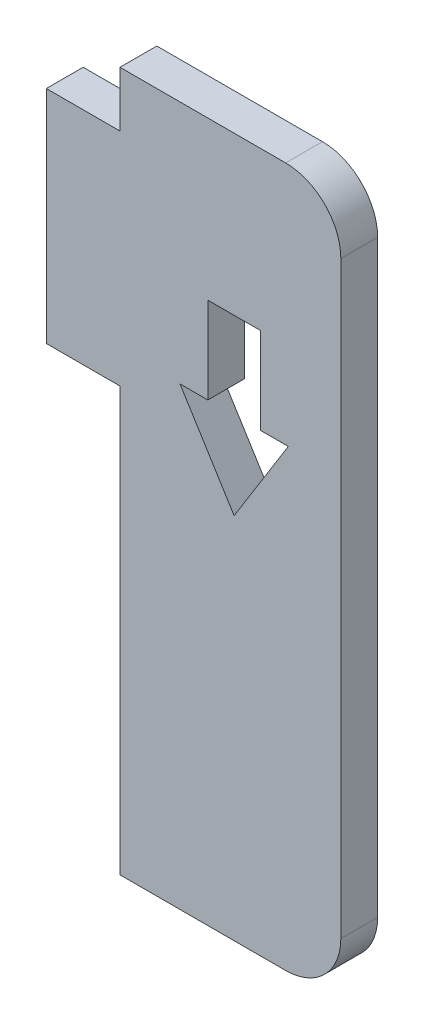
ISO-10303-21;
HEADER;
FILE_DESCRIPTION(('STEP AP214'),'2;1');
FILE_NAME('part.step','',(''),(''),'','','');
FILE_SCHEMA(('AUTOMOTIVE_DESIGN { 1 0 10303 214 1 1 1 1 }'));
ENDSEC;
DATA;
#1=APPLICATION_CONTEXT('core data for automotive mechanical design processes');
#2=APPLICATION_PROTOCOL_DEFINITION('international standard','automotive_design',2000,#1);
#3=PRODUCT_CONTEXT('',#1,'mechanical');
#4=PRODUCT('Part','Part','',(#3));
#5=PRODUCT_RELATED_PRODUCT_CATEGORY('part','',(#4));
#6=PRODUCT_DEFINITION_FORMATION('','',#4);
#7=PRODUCT_DEFINITION_CONTEXT('part definition',#1,'design');
#8=PRODUCT_DEFINITION('design','',#6,#7);
#9=PRODUCT_DEFINITION_SHAPE('','',#8);
#10=(LENGTH_UNIT() NAMED_UNIT(*) SI_UNIT(.MILLI.,.METRE.));
#11=(NAMED_UNIT(*) PLANE_ANGLE_UNIT() SI_UNIT($,.RADIAN.));
#12=(NAMED_UNIT(*) SI_UNIT($,.STERADIAN.) SOLID_ANGLE_UNIT());
#13=UNCERTAINTY_MEASURE_WITH_UNIT(LENGTH_MEASURE(1.E-05),#10,'distance_accuracy_value','');
#14=(GEOMETRIC_REPRESENTATION_CONTEXT(3) GLOBAL_UNCERTAINTY_ASSIGNED_CONTEXT((#13)) GLOBAL_UNIT_ASSIGNED_CONTEXT((#10,
#11,#12)) REPRESENTATION_CONTEXT('',''));
#15=CARTESIAN_POINT('',(0.,0.,0.));
#16=DIRECTION('',(0.,0.,1.));
#17=DIRECTION('',(1.,0.,0.));
#18=AXIS2_PLACEMENT_3D('',#15,#16,#17);
#19=CARTESIAN_POINT('',(4.,0.,2.));
#20=DIRECTION('',(1.,0.,0.));
#21=DIRECTION('',(0.,1.,0.));
#22=AXIS2_PLACEMENT_3D('',#19,#20,#21);
#23=PLANE('',#22);
#24=DIRECTION('',(0.,-1.,0.));
#25=VECTOR('',#24,1.);
#26=CARTESIAN_POINT('',(4.,0.,0.));
#27=LINE('',#26,#25);
#28=CARTESIAN_POINT('',(4.,-12.,0.));
#29=VERTEX_POINT('',#28);
#30=CARTESIAN_POINT('',(4.,-35.,0.));
#31=VERTEX_POINT('',#30);
#32=EDGE_CURVE('E234',#29,#31,#27,.T.);
#33=ORIENTED_EDGE('',*,*,#32,.T.);
#34=DIRECTION('',(0.,0.,-1.));
#35=VECTOR('',#34,1.);
#36=CARTESIAN_POINT('',(4.,-35.,2.));
#37=LINE('',#36,#35);
#38=CARTESIAN_POINT('',(4.,-35.,2.));
#39=VERTEX_POINT('',#38);
#40=EDGE_CURVE('E319',#39,#31,#37,.T.);
#41=ORIENTED_EDGE('',*,*,#40,.F.);
#42=DIRECTION('',(0.,-1.,0.));
#43=VECTOR('',#42,1.);
#44=CARTESIAN_POINT('',(4.,0.,2.));
#45=LINE('',#44,#43);
#46=CARTESIAN_POINT('',(4.,-12.,2.));
#47=VERTEX_POINT('',#46);
#48=EDGE_CURVE('E249',#47,#39,#45,.T.);
#49=ORIENTED_EDGE('',*,*,#48,.F.);
#50=DIRECTION('',(0.,0.,-1.));
#51=VECTOR('',#50,1.);
#52=CARTESIAN_POINT('',(4.,-12.,2.));
#53=LINE('',#52,#51);
#54=EDGE_CURVE('E275',#47,#29,#53,.T.);
#55=ORIENTED_EDGE('',*,*,#54,.T.);
#56=EDGE_LOOP('',(#33,#41,#49,#55));
#57=FACE_BOUND('',#56,.T.);
#58=ADVANCED_FACE('F38',(#57),#23,.F.);
#59=CARTESIAN_POINT('',(0.,-35.,2.));
#60=DIRECTION('',(0.,1.,0.));
#61=DIRECTION('',(0.,0.,1.));
#62=AXIS2_PLACEMENT_3D('',#59,#60,#61);
#63=PLANE('',#62);
#64=DIRECTION('',(1.,0.,0.));
#65=VECTOR('',#64,1.);
#66=CARTESIAN_POINT('',(0.,-35.,0.));
#67=LINE('',#66,#65);
#68=CARTESIAN_POINT('',(13.,-35.,0.));
#69=VERTEX_POINT('',#68);
#70=EDGE_CURVE('E279',#31,#69,#67,.T.);
#71=ORIENTED_EDGE('',*,*,#70,.T.);
#72=DIRECTION('',(0.,0.,-1.));
#73=VECTOR('',#72,1.);
#74=CARTESIAN_POINT('',(13.,-35.,2.));
#75=LINE('',#74,#73);
#76=CARTESIAN_POINT('',(13.,-35.,2.));
#77=VERTEX_POINT('',#76);
#78=EDGE_CURVE('E62',#69,#77,#75,.F.);
#79=ORIENTED_EDGE('',*,*,#78,.T.);
#80=DIRECTION('',(1.,0.,0.));
#81=VECTOR('',#80,1.);
#82=CARTESIAN_POINT('',(0.,-35.,2.));
#83=LINE('',#82,#81);
#84=EDGE_CURVE('E253',#39,#77,#83,.T.);
#85=ORIENTED_EDGE('',*,*,#84,.F.);
#86=ORIENTED_EDGE('',*,*,#40,.T.);
#87=EDGE_LOOP('',(#71,#79,#85,#86));
#88=FACE_BOUND('',#87,.T.);
#89=ADVANCED_FACE('F351',(#88),#63,.F.);
#90=CARTESIAN_POINT('',(16.,0.,2.));
#91=DIRECTION('',(-1.,0.,0.));
#92=DIRECTION('',(0.,0.,1.));
#93=AXIS2_PLACEMENT_3D('',#90,#91,#92);
#94=PLANE('',#93);
#95=DIRECTION('',(0.,1.,0.));
#96=VECTOR('',#95,1.);
#97=CARTESIAN_POINT('',(16.,0.,2.));
#98=LINE('',#97,#96);
#99=CARTESIAN_POINT('',(16.,-32.,2.));
#100=VERTEX_POINT('',#99);
#101=CARTESIAN_POINT('',(16.,0.,2.));
#102=VERTEX_POINT('',#101);
#103=EDGE_CURVE('E257',#100,#102,#98,.T.);
#104=ORIENTED_EDGE('',*,*,#103,.F.);
#105=DIRECTION('',(0.,0.,-1.));
#106=VECTOR('',#105,1.);
#107=CARTESIAN_POINT('',(16.,-32.,2.));
#108=LINE('',#107,#106);
#109=CARTESIAN_POINT('',(16.,-32.,0.));
#110=VERTEX_POINT('',#109);
#111=EDGE_CURVE('E326',#100,#110,#108,.T.);
#112=ORIENTED_EDGE('',*,*,#111,.T.);
#113=DIRECTION('',(0.,1.,0.));
#114=VECTOR('',#113,1.);
#115=CARTESIAN_POINT('',(16.,0.,0.));
#116=LINE('',#115,#114);
#117=CARTESIAN_POINT('',(16.,0.,0.));
#118=VERTEX_POINT('',#117);
#119=EDGE_CURVE('E282',#110,#118,#116,.T.);
#120=ORIENTED_EDGE('',*,*,#119,.T.);
#121=DIRECTION('',(0.,0.,-1.));
#122=VECTOR('',#121,1.);
#123=CARTESIAN_POINT('',(16.,0.,2.));
#124=LINE('',#123,#122);
#125=EDGE_CURVE('E323',#118,#102,#124,.F.);
#126=ORIENTED_EDGE('',*,*,#125,.T.);
#127=EDGE_LOOP('',(#104,#112,#120,#126));
#128=FACE_BOUND('',#127,.T.);
#129=ADVANCED_FACE('F346',(#128),#94,.F.);
#130=CARTESIAN_POINT('',(0.,3.,2.));
#131=DIRECTION('',(0.,-1.,0.));
#132=DIRECTION('',(1.,0.,0.));
#133=AXIS2_PLACEMENT_3D('',#130,#131,#132);
#134=PLANE('',#133);
#135=DIRECTION('',(-1.,0.,0.));
#136=VECTOR('',#135,1.);
#137=CARTESIAN_POINT('',(0.,3.,2.));
#138=LINE('',#137,#136);
#139=CARTESIAN_POINT('',(13.,3.,2.));
#140=VERTEX_POINT('',#139);
#141=CARTESIAN_POINT('',(4.,3.,2.));
#142=VERTEX_POINT('',#141);
#143=EDGE_CURVE('E260',#140,#142,#138,.T.);
#144=ORIENTED_EDGE('',*,*,#143,.F.);
#145=DIRECTION('',(0.,0.,-1.));
#146=VECTOR('',#145,1.);
#147=CARTESIAN_POINT('',(13.,3.,2.));
#148=LINE('',#147,#146);
#149=CARTESIAN_POINT('',(13.,3.,0.));
#150=VERTEX_POINT('',#149);
#151=EDGE_CURVE('E11',#140,#150,#148,.T.);
#152=ORIENTED_EDGE('',*,*,#151,.T.);
#153=DIRECTION('',(-1.,0.,0.));
#154=VECTOR('',#153,1.);
#155=CARTESIAN_POINT('',(0.,3.,0.));
#156=LINE('',#155,#154);
#157=CARTESIAN_POINT('',(4.,3.,0.));
#158=VERTEX_POINT('',#157);
#159=EDGE_CURVE('E286',#150,#158,#156,.T.);
#160=ORIENTED_EDGE('',*,*,#159,.T.);
#161=DIRECTION('',(0.,0.,-1.));
#162=VECTOR('',#161,1.);
#163=CARTESIAN_POINT('',(4.,3.,2.));
#164=LINE('',#163,#162);
#165=EDGE_CURVE('E315',#142,#158,#164,.T.);
#166=ORIENTED_EDGE('',*,*,#165,.F.);
#167=EDGE_LOOP('',(#144,#152,#160,#166));
#168=FACE_BOUND('',#167,.T.);
#169=ADVANCED_FACE('F378',(#168),#134,.F.);
#170=CARTESIAN_POINT('',(4.,0.,2.));
#171=DIRECTION('',(1.,0.,0.));
#172=DIRECTION('',(0.,0.,-1.));
#173=AXIS2_PLACEMENT_3D('',#170,#171,#172);
#174=PLANE('',#173);
#175=DIRECTION('',(0.,-1.,0.));
#176=VECTOR('',#175,1.);
#177=CARTESIAN_POINT('',(4.,0.,0.));
#178=LINE('',#177,#176);
#179=CARTESIAN_POINT('',(4.,0.,0.));
#180=VERTEX_POINT('',#179);
#181=EDGE_CURVE('E289',#158,#180,#178,.T.);
#182=ORIENTED_EDGE('',*,*,#181,.T.);
#183=DIRECTION('',(0.,0.,-1.));
#184=VECTOR('',#183,1.);
#185=CARTESIAN_POINT('',(4.,0.,2.));
#186=LINE('',#185,#184);
#187=CARTESIAN_POINT('',(4.,0.,2.));
#188=VERTEX_POINT('',#187);
#189=EDGE_CURVE('E311',#188,#180,#186,.T.);
#190=ORIENTED_EDGE('',*,*,#189,.F.);
#191=DIRECTION('',(0.,-1.,0.));
#192=VECTOR('',#191,1.);
#193=CARTESIAN_POINT('',(4.,0.,2.));
#194=LINE('',#193,#192);
#195=EDGE_CURVE('E263',#142,#188,#194,.T.);
#196=ORIENTED_EDGE('',*,*,#195,.F.);
#197=ORIENTED_EDGE('',*,*,#165,.T.);
#198=EDGE_LOOP('',(#182,#190,#196,#197));
#199=FACE_BOUND('',#198,.T.);
#200=ADVANCED_FACE('F374',(#199),#174,.F.);
#201=CARTESIAN_POINT('',(0.,0.,2.));
#202=DIRECTION('',(0.,-1.,0.));
#203=DIRECTION('',(1.,0.,0.));
#204=AXIS2_PLACEMENT_3D('',#201,#202,#203);
#205=PLANE('',#204);
#206=DIRECTION('',(-1.,0.,0.));
#207=VECTOR('',#206,1.);
#208=CARTESIAN_POINT('',(0.,0.,0.));
#209=LINE('',#208,#207);
#210=CARTESIAN_POINT('',(0.,0.,0.));
#211=VERTEX_POINT('',#210);
#212=EDGE_CURVE('E292',#180,#211,#209,.T.);
#213=ORIENTED_EDGE('',*,*,#212,.T.);
#214=DIRECTION('',(0.,0.,-1.));
#215=VECTOR('',#214,1.);
#216=CARTESIAN_POINT('',(0.,0.,2.));
#217=LINE('',#216,#215);
#218=CARTESIAN_POINT('',(0.,0.,2.));
#219=VERTEX_POINT('',#218);
#220=EDGE_CURVE('E307',#219,#211,#217,.T.);
#221=ORIENTED_EDGE('',*,*,#220,.F.);
#222=DIRECTION('',(-1.,0.,0.));
#223=VECTOR('',#222,1.);
#224=CARTESIAN_POINT('',(0.,0.,2.));
#225=LINE('',#224,#223);
#226=EDGE_CURVE('E266',#188,#219,#225,.T.);
#227=ORIENTED_EDGE('',*,*,#226,.F.);
#228=ORIENTED_EDGE('',*,*,#189,.T.);
#229=EDGE_LOOP('',(#213,#221,#227,#228));
#230=FACE_BOUND('',#229,.T.);
#231=ADVANCED_FACE('F369',(#230),#205,.F.);
#232=CARTESIAN_POINT('',(0.,0.,2.));
#233=DIRECTION('',(1.,0.,0.));
#234=DIRECTION('',(0.,0.,-1.));
#235=AXIS2_PLACEMENT_3D('',#232,#233,#234);
#236=PLANE('',#235);
#237=DIRECTION('',(0.,-1.,0.));
#238=VECTOR('',#237,1.);
#239=CARTESIAN_POINT('',(0.,0.,0.));
#240=LINE('',#239,#238);
#241=CARTESIAN_POINT('',(0.,-12.,0.));
#242=VERTEX_POINT('',#241);
#243=EDGE_CURVE('E295',#211,#242,#240,.T.);
#244=ORIENTED_EDGE('',*,*,#243,.T.);
#245=DIRECTION('',(0.,0.,-1.));
#246=VECTOR('',#245,1.);
#247=CARTESIAN_POINT('',(0.,-12.,2.));
#248=LINE('',#247,#246);
#249=CARTESIAN_POINT('',(0.,-12.,2.));
#250=VERTEX_POINT('',#249);
#251=EDGE_CURVE('E303',#250,#242,#248,.T.);
#252=ORIENTED_EDGE('',*,*,#251,.F.);
#253=DIRECTION('',(0.,-1.,0.));
#254=VECTOR('',#253,1.);
#255=CARTESIAN_POINT('',(0.,0.,2.));
#256=LINE('',#255,#254);
#257=EDGE_CURVE('E269',#219,#250,#256,.T.);
#258=ORIENTED_EDGE('',*,*,#257,.F.);
#259=ORIENTED_EDGE('',*,*,#220,.T.);
#260=EDGE_LOOP('',(#244,#252,#258,#259));
#261=FACE_BOUND('',#260,.T.);
#262=ADVANCED_FACE('F365',(#261),#236,.F.);
#263=CARTESIAN_POINT('',(0.,-12.,2.));
#264=DIRECTION('',(0.,1.,0.));
#265=DIRECTION('',(0.,0.,1.));
#266=AXIS2_PLACEMENT_3D('',#263,#264,#265);
#267=PLANE('',#266);
#268=DIRECTION('',(1.,0.,0.));
#269=VECTOR('',#268,1.);
#270=CARTESIAN_POINT('',(0.,-12.,0.));
#271=LINE('',#270,#269);
#272=EDGE_CURVE('E254',#242,#29,#271,.T.);
#273=ORIENTED_EDGE('',*,*,#272,.T.);
#274=ORIENTED_EDGE('',*,*,#54,.F.);
#275=DIRECTION('',(1.,0.,0.));
#276=VECTOR('',#275,1.);
#277=CARTESIAN_POINT('',(0.,-12.,2.));
#278=LINE('',#277,#276);
#279=EDGE_CURVE('E272',#250,#47,#278,.T.);
#280=ORIENTED_EDGE('',*,*,#279,.F.);
#281=ORIENTED_EDGE('',*,*,#251,.T.);
#282=EDGE_LOOP('',(#273,#274,#280,#281));
#283=FACE_BOUND('',#282,.T.);
#284=ADVANCED_FACE('F360',(#283),#267,.F.);
#285=CARTESIAN_POINT('',(0.,0.,2.));
#286=DIRECTION('',(0.,0.,1.));
#287=DIRECTION('',(1.,0.,0.));
#288=AXIS2_PLACEMENT_3D('',#285,#286,#287);
#289=PLANE('',#288);
#290=DIRECTION('',(0.,-1.,0.));
#291=VECTOR('',#290,1.);
#292=CARTESIAN_POINT('',(8.77294126566062,-5.57008760873415,2.));
#293=LINE('',#292,#291);
#294=CARTESIAN_POINT('',(8.77294126566062,-5.57008760873415,2.));
#295=VERTEX_POINT('',#294);
#296=CARTESIAN_POINT('',(8.77294126566062,-10.2686378183035,2.));
#297=VERTEX_POINT('',#296);
#298=EDGE_CURVE('E167',#295,#297,#293,.T.);
#299=ORIENTED_EDGE('',*,*,#298,.F.);
#300=DIRECTION('',(-1.,0.,0.));
#301=VECTOR('',#300,1.);
#302=CARTESIAN_POINT('',(11.6328239486049,-5.57008760873415,2.));
#303=LINE('',#302,#301);
#304=CARTESIAN_POINT('',(11.6328239486049,-5.57008760873415,2.));
#305=VERTEX_POINT('',#304);
#306=EDGE_CURVE('E189',#305,#295,#303,.T.);
#307=ORIENTED_EDGE('',*,*,#306,.F.);
#308=DIRECTION('',(0.,1.,0.));
#309=VECTOR('',#308,1.);
#310=CARTESIAN_POINT('',(11.6328239486049,-5.57008760873415,2.));
#311=LINE('',#310,#309);
#312=CARTESIAN_POINT('',(11.6328239486049,-10.2686378183035,2.));
#313=VERTEX_POINT('',#312);
#314=EDGE_CURVE('E193',#313,#305,#311,.T.);
#315=ORIENTED_EDGE('',*,*,#314,.F.);
#316=DIRECTION('',(-1.,0.,0.));
#317=VECTOR('',#316,1.);
#318=CARTESIAN_POINT('',(11.6328239486049,-10.2686378183035,2.));
#319=LINE('',#318,#317);
#320=CARTESIAN_POINT('',(13.1449882977054,-10.2686378183035,2.));
#321=VERTEX_POINT('',#320);
#322=EDGE_CURVE('E224',#321,#313,#319,.T.);
#323=ORIENTED_EDGE('',*,*,#322,.F.);
#324=DIRECTION('',(0.528064436524394,0.849204304557021,0.));
#325=VECTOR('',#324,1.);
#326=CARTESIAN_POINT('',(13.1449882977054,-10.2686378183035,2.));
#327=LINE('',#326,#325);
#328=CARTESIAN_POINT('',(10.2028826071328,-14.9999710497937,2.));
#329=VERTEX_POINT('',#328);
#330=EDGE_CURVE('E220',#329,#321,#327,.T.);
#331=ORIENTED_EDGE('',*,*,#330,.F.);
#332=DIRECTION('',(0.528064436524394,-0.849204304557021,0.));
#333=VECTOR('',#332,1.);
#334=CARTESIAN_POINT('',(7.26077691656009,-10.2686378183035,2.));
#335=LINE('',#334,#333);
#336=CARTESIAN_POINT('',(7.26077691656009,-10.2686378183035,2.));
#337=VERTEX_POINT('',#336);
#338=EDGE_CURVE('E216',#337,#329,#335,.T.);
#339=ORIENTED_EDGE('',*,*,#338,.F.);
#340=DIRECTION('',(-1.,0.,0.));
#341=VECTOR('',#340,1.);
#342=CARTESIAN_POINT('',(8.77294126566062,-10.2686378183035,2.));
#343=LINE('',#342,#341);
#344=EDGE_CURVE('E213',#297,#337,#343,.T.);
#345=ORIENTED_EDGE('',*,*,#344,.F.);
#346=EDGE_LOOP('',(#299,#307,#315,#323,#331,#339,#345));
#347=FACE_BOUND('',#346,.T.);
#348=ORIENTED_EDGE('',*,*,#84,.T.);
#349=CARTESIAN_POINT('',(13.,-32.,2.));
#350=DIRECTION('',(0.,0.,1.));
#351=DIRECTION('',(1.,0.,0.));
#352=AXIS2_PLACEMENT_3D('',#349,#350,#351);
#353=CIRCLE('',#352,3.);
#354=EDGE_CURVE('E47',#77,#100,#353,.T.);
#355=ORIENTED_EDGE('',*,*,#354,.T.);
#356=ORIENTED_EDGE('',*,*,#103,.T.);
#357=CARTESIAN_POINT('',(13.,0.,2.));
#358=DIRECTION('',(0.,0.,1.));
#359=DIRECTION('',(1.,0.,0.));
#360=AXIS2_PLACEMENT_3D('',#357,#358,#359);
#361=CIRCLE('',#360,3.);
#362=EDGE_CURVE('E54',#102,#140,#361,.T.);
#363=ORIENTED_EDGE('',*,*,#362,.T.);
#364=ORIENTED_EDGE('',*,*,#143,.T.);
#365=ORIENTED_EDGE('',*,*,#195,.T.);
#366=ORIENTED_EDGE('',*,*,#226,.T.);
#367=ORIENTED_EDGE('',*,*,#257,.T.);
#368=ORIENTED_EDGE('',*,*,#279,.T.);
#369=ORIENTED_EDGE('',*,*,#48,.T.);
#370=EDGE_LOOP('',(#348,#355,#356,#363,#364,#365,#366,#367,#368,#369));
#371=FACE_BOUND('',#370,.T.);
#372=ADVANCED_FACE('F342',(#347,#371),#289,.T.);
#373=CARTESIAN_POINT('',(0.,0.,0.));
#374=DIRECTION('',(0.,0.,1.));
#375=DIRECTION('',(1.,0.,0.));
#376=AXIS2_PLACEMENT_3D('',#373,#374,#375);
#377=PLANE('',#376);
#378=DIRECTION('',(-1.,0.,0.));
#379=VECTOR('',#378,1.);
#380=CARTESIAN_POINT('',(11.6328239486049,-5.57008760873415,0.));
#381=LINE('',#380,#379);
#382=CARTESIAN_POINT('',(11.6328239486049,-5.57008760873415,0.));
#383=VERTEX_POINT('',#382);
#384=CARTESIAN_POINT('',(8.77294126566062,-5.57008760873415,0.));
#385=VERTEX_POINT('',#384);
#386=EDGE_CURVE('E173',#383,#385,#381,.T.);
#387=ORIENTED_EDGE('',*,*,#386,.T.);
#388=DIRECTION('',(0.,-1.,0.));
#389=VECTOR('',#388,1.);
#390=CARTESIAN_POINT('',(8.77294126566062,-5.57008760873415,0.));
#391=LINE('',#390,#389);
#392=CARTESIAN_POINT('',(8.77294126566062,-10.2686378183035,0.));
#393=VERTEX_POINT('',#392);
#394=EDGE_CURVE('E164',#385,#393,#391,.T.);
#395=ORIENTED_EDGE('',*,*,#394,.T.);
#396=DIRECTION('',(-1.,0.,0.));
#397=VECTOR('',#396,1.);
#398=CARTESIAN_POINT('',(8.77294126566062,-10.2686378183035,0.));
#399=LINE('',#398,#397);
#400=CARTESIAN_POINT('',(7.26077691656009,-10.2686378183035,0.));
#401=VERTEX_POINT('',#400);
#402=EDGE_CURVE('E177',#393,#401,#399,.T.);
#403=ORIENTED_EDGE('',*,*,#402,.T.);
#404=DIRECTION('',(0.528064436524394,-0.849204304557021,0.));
#405=VECTOR('',#404,1.);
#406=CARTESIAN_POINT('',(7.26077691656009,-10.2686378183035,0.));
#407=LINE('',#406,#405);
#408=CARTESIAN_POINT('',(10.2028826071328,-14.9999710497937,0.));
#409=VERTEX_POINT('',#408);
#410=EDGE_CURVE('E182',#401,#409,#407,.T.);
#411=ORIENTED_EDGE('',*,*,#410,.T.);
#412=DIRECTION('',(0.528064436524394,0.849204304557021,0.));
#413=VECTOR('',#412,1.);
#414=CARTESIAN_POINT('',(13.1449882977054,-10.2686378183035,0.));
#415=LINE('',#414,#413);
#416=CARTESIAN_POINT('',(13.1449882977054,-10.2686378183035,0.));
#417=VERTEX_POINT('',#416);
#418=EDGE_CURVE('E198',#409,#417,#415,.T.);
#419=ORIENTED_EDGE('',*,*,#418,.T.);
#420=DIRECTION('',(-1.,0.,0.));
#421=VECTOR('',#420,1.);
#422=CARTESIAN_POINT('',(11.6328239486049,-10.2686378183035,0.));
#423=LINE('',#422,#421);
#424=CARTESIAN_POINT('',(11.6328239486049,-10.2686378183035,0.));
#425=VERTEX_POINT('',#424);
#426=EDGE_CURVE('E202',#417,#425,#423,.T.);
#427=ORIENTED_EDGE('',*,*,#426,.T.);
#428=DIRECTION('',(0.,1.,0.));
#429=VECTOR('',#428,1.);
#430=CARTESIAN_POINT('',(11.6328239486049,-5.57008760873415,0.));
#431=LINE('',#430,#429);
#432=EDGE_CURVE('E206',#425,#383,#431,.T.);
#433=ORIENTED_EDGE('',*,*,#432,.T.);
#434=EDGE_LOOP('',(#387,#395,#403,#411,#419,#427,#433));
#435=FACE_BOUND('',#434,.T.);
#436=ORIENTED_EDGE('',*,*,#119,.F.);
#437=CARTESIAN_POINT('',(13.,-32.,0.));
#438=DIRECTION('',(0.,0.,1.));
#439=DIRECTION('',(1.,0.,0.));
#440=AXIS2_PLACEMENT_3D('',#437,#438,#439);
#441=CIRCLE('',#440,3.);
#442=EDGE_CURVE('E333',#110,#69,#441,.F.);
#443=ORIENTED_EDGE('',*,*,#442,.T.);
#444=ORIENTED_EDGE('',*,*,#70,.F.);
#445=ORIENTED_EDGE('',*,*,#32,.F.);
#446=ORIENTED_EDGE('',*,*,#272,.F.);
#447=ORIENTED_EDGE('',*,*,#243,.F.);
#448=ORIENTED_EDGE('',*,*,#212,.F.);
#449=ORIENTED_EDGE('',*,*,#181,.F.);
#450=ORIENTED_EDGE('',*,*,#159,.F.);
#451=CARTESIAN_POINT('',(13.,0.,0.));
#452=DIRECTION('',(0.,0.,1.));
#453=DIRECTION('',(1.,0.,0.));
#454=AXIS2_PLACEMENT_3D('',#451,#452,#453);
#455=CIRCLE('',#454,3.);
#456=EDGE_CURVE('E330',#150,#118,#455,.F.);
#457=ORIENTED_EDGE('',*,*,#456,.T.);
#458=EDGE_LOOP('',(#436,#443,#444,#445,#446,#447,#448,#449,#450,#457));
#459=FACE_BOUND('',#458,.T.);
#460=ADVANCED_FACE('F184',(#435,#459),#377,.F.);
#461=CARTESIAN_POINT('',(8.77294126566062,-5.57008760873415,0.));
#462=DIRECTION('',(-1.,0.,0.));
#463=DIRECTION('',(0.,0.,1.));
#464=AXIS2_PLACEMENT_3D('',#461,#462,#463);
#465=PLANE('',#464);
#466=ORIENTED_EDGE('',*,*,#298,.T.);
#467=DIRECTION('',(0.,0.,1.));
#468=VECTOR('',#467,1.);
#469=CARTESIAN_POINT('',(8.77294126566062,-10.2686378183035,0.));
#470=LINE('',#469,#468);
#471=EDGE_CURVE('E160',#393,#297,#470,.T.);
#472=ORIENTED_EDGE('',*,*,#471,.F.);
#473=ORIENTED_EDGE('',*,*,#394,.F.);
#474=DIRECTION('',(0.,0.,1.));
#475=VECTOR('',#474,1.);
#476=CARTESIAN_POINT('',(8.77294126566062,-5.57008760873415,0.));
#477=LINE('',#476,#475);
#478=EDGE_CURVE('E231',#385,#295,#477,.T.);
#479=ORIENTED_EDGE('',*,*,#478,.T.);
#480=EDGE_LOOP('',(#466,#472,#473,#479));
#481=FACE_BOUND('',#480,.T.);
#482=ADVANCED_FACE('F162',(#481),#465,.F.);
#483=CARTESIAN_POINT('',(11.6328239486049,-5.57008760873415,0.));
#484=DIRECTION('',(0.,1.,0.));
#485=DIRECTION('',(-1.,0.,0.));
#486=AXIS2_PLACEMENT_3D('',#483,#484,#485);
#487=PLANE('',#486);
#488=ORIENTED_EDGE('',*,*,#306,.T.);
#489=ORIENTED_EDGE('',*,*,#478,.F.);
#490=ORIENTED_EDGE('',*,*,#386,.F.);
#491=DIRECTION('',(0.,0.,1.));
#492=VECTOR('',#491,1.);
#493=CARTESIAN_POINT('',(11.6328239486049,-5.57008760873415,0.));
#494=LINE('',#493,#492);
#495=EDGE_CURVE('E235',#383,#305,#494,.T.);
#496=ORIENTED_EDGE('',*,*,#495,.T.);
#497=EDGE_LOOP('',(#488,#489,#490,#496));
#498=FACE_BOUND('',#497,.T.);
#499=ADVANCED_FACE('F412',(#498),#487,.F.);
#500=CARTESIAN_POINT('',(11.6328239486049,-5.57008760873415,0.));
#501=DIRECTION('',(1.,0.,0.));
#502=DIRECTION('',(0.,0.,-1.));
#503=AXIS2_PLACEMENT_3D('',#500,#501,#502);
#504=PLANE('',#503);
#505=ORIENTED_EDGE('',*,*,#314,.T.);
#506=ORIENTED_EDGE('',*,*,#495,.F.);
#507=ORIENTED_EDGE('',*,*,#432,.F.);
#508=DIRECTION('',(0.,0.,1.));
#509=VECTOR('',#508,1.);
#510=CARTESIAN_POINT('',(11.6328239486049,-10.2686378183035,0.));
#511=LINE('',#510,#509);
#512=EDGE_CURVE('E238',#425,#313,#511,.T.);
#513=ORIENTED_EDGE('',*,*,#512,.T.);
#514=EDGE_LOOP('',(#505,#506,#507,#513));
#515=FACE_BOUND('',#514,.T.);
#516=ADVANCED_FACE('F426',(#515),#504,.F.);
#517=CARTESIAN_POINT('',(11.6328239486049,-10.2686378183035,0.));
#518=DIRECTION('',(0.,1.,0.));
#519=DIRECTION('',(-1.,0.,0.));
#520=AXIS2_PLACEMENT_3D('',#517,#518,#519);
#521=PLANE('',#520);
#522=ORIENTED_EDGE('',*,*,#322,.T.);
#523=ORIENTED_EDGE('',*,*,#512,.F.);
#524=ORIENTED_EDGE('',*,*,#426,.F.);
#525=DIRECTION('',(0.,0.,1.));
#526=VECTOR('',#525,1.);
#527=CARTESIAN_POINT('',(13.1449882977054,-10.2686378183035,0.));
#528=LINE('',#527,#526);
#529=EDGE_CURVE('E241',#417,#321,#528,.T.);
#530=ORIENTED_EDGE('',*,*,#529,.T.);
#531=EDGE_LOOP('',(#522,#523,#524,#530));
#532=FACE_BOUND('',#531,.T.);
#533=ADVANCED_FACE('F422',(#532),#521,.F.);
#534=CARTESIAN_POINT('',(13.1449882977054,-10.2686378183035,0.));
#535=DIRECTION('',(0.849204304557021,-0.528064436524394,0.));
#536=DIRECTION('',(0.528064436524394,0.849204304557021,0.));
#537=AXIS2_PLACEMENT_3D('',#534,#535,#536);
#538=PLANE('',#537);
#539=ORIENTED_EDGE('',*,*,#330,.T.);
#540=ORIENTED_EDGE('',*,*,#529,.F.);
#541=ORIENTED_EDGE('',*,*,#418,.F.);
#542=DIRECTION('',(0.,0.,1.));
#543=VECTOR('',#542,1.);
#544=CARTESIAN_POINT('',(10.2028826071328,-14.9999710497937,0.));
#545=LINE('',#544,#543);
#546=EDGE_CURVE('E244',#409,#329,#545,.T.);
#547=ORIENTED_EDGE('',*,*,#546,.T.);
#548=EDGE_LOOP('',(#539,#540,#541,#547));
#549=FACE_BOUND('',#548,.T.);
#550=ADVANCED_FACE('F418',(#549),#538,.F.);
#551=CARTESIAN_POINT('',(7.26077691656009,-10.2686378183035,0.));
#552=DIRECTION('',(-0.849204304557021,-0.528064436524394,0.));
#553=DIRECTION('',(0.528064436524394,-0.849204304557021,0.));
#554=AXIS2_PLACEMENT_3D('',#551,#552,#553);
#555=PLANE('',#554);
#556=ORIENTED_EDGE('',*,*,#338,.T.);
#557=ORIENTED_EDGE('',*,*,#546,.F.);
#558=ORIENTED_EDGE('',*,*,#410,.F.);
#559=DIRECTION('',(0.,0.,1.));
#560=VECTOR('',#559,1.);
#561=CARTESIAN_POINT('',(7.26077691656009,-10.2686378183035,0.));
#562=LINE('',#561,#560);
#563=EDGE_CURVE('E172',#401,#337,#562,.T.);
#564=ORIENTED_EDGE('',*,*,#563,.T.);
#565=EDGE_LOOP('',(#556,#557,#558,#564));
#566=FACE_BOUND('',#565,.T.);
#567=ADVANCED_FACE('F415',(#566),#555,.F.);
#568=CARTESIAN_POINT('',(8.77294126566062,-10.2686378183035,0.));
#569=DIRECTION('',(0.,1.,0.));
#570=DIRECTION('',(-1.,0.,0.));
#571=AXIS2_PLACEMENT_3D('',#568,#569,#570);
#572=PLANE('',#571);
#573=ORIENTED_EDGE('',*,*,#344,.T.);
#574=ORIENTED_EDGE('',*,*,#563,.F.);
#575=ORIENTED_EDGE('',*,*,#402,.F.);
#576=ORIENTED_EDGE('',*,*,#471,.T.);
#577=EDGE_LOOP('',(#573,#574,#575,#576));
#578=FACE_BOUND('',#577,.T.);
#579=ADVANCED_FACE('F178',(#578),#572,.F.);
#580=CARTESIAN_POINT('',(13.,-32.,2.));
#581=DIRECTION('',(0.,0.,-1.));
#582=DIRECTION('',(-1.,0.,0.));
#583=AXIS2_PLACEMENT_3D('',#580,#581,#582);
#584=CYLINDRICAL_SURFACE('',#583,3.);
#585=ORIENTED_EDGE('',*,*,#354,.F.);
#586=ORIENTED_EDGE('',*,*,#78,.F.);
#587=ORIENTED_EDGE('',*,*,#442,.F.);
#588=ORIENTED_EDGE('',*,*,#111,.F.);
#589=EDGE_LOOP('',(#585,#586,#587,#588));
#590=FACE_BOUND('',#589,.T.);
#591=ADVANCED_FACE('F349',(#590),#584,.T.);
#592=CARTESIAN_POINT('',(13.,0.,2.));
#593=DIRECTION('',(0.,0.,-1.));
#594=DIRECTION('',(-1.,0.,0.));
#595=AXIS2_PLACEMENT_3D('',#592,#593,#594);
#596=CYLINDRICAL_SURFACE('',#595,3.);
#597=ORIENTED_EDGE('',*,*,#362,.F.);
#598=ORIENTED_EDGE('',*,*,#125,.F.);
#599=ORIENTED_EDGE('',*,*,#456,.F.);
#600=ORIENTED_EDGE('',*,*,#151,.F.);
#601=EDGE_LOOP('',(#597,#598,#599,#600));
#602=FACE_BOUND('',#601,.T.);
#603=ADVANCED_FACE('F40',(#602),#596,.T.);
#604=CLOSED_SHELL('',(#58,#89,#129,#169,#200,#231,#262,#284,#372,#460,#482,#499,#516,#533,#550,
#567,#579,#591,#603));
#605=MANIFOLD_SOLID_BREP('B2',#604);
#606=ADVANCED_BREP_SHAPE_REPRESENTATION('',(#18,#605),#14);
#607=SHAPE_DEFINITION_REPRESENTATION(#9,#606);
ENDSEC;
END-ISO-10303-21;
